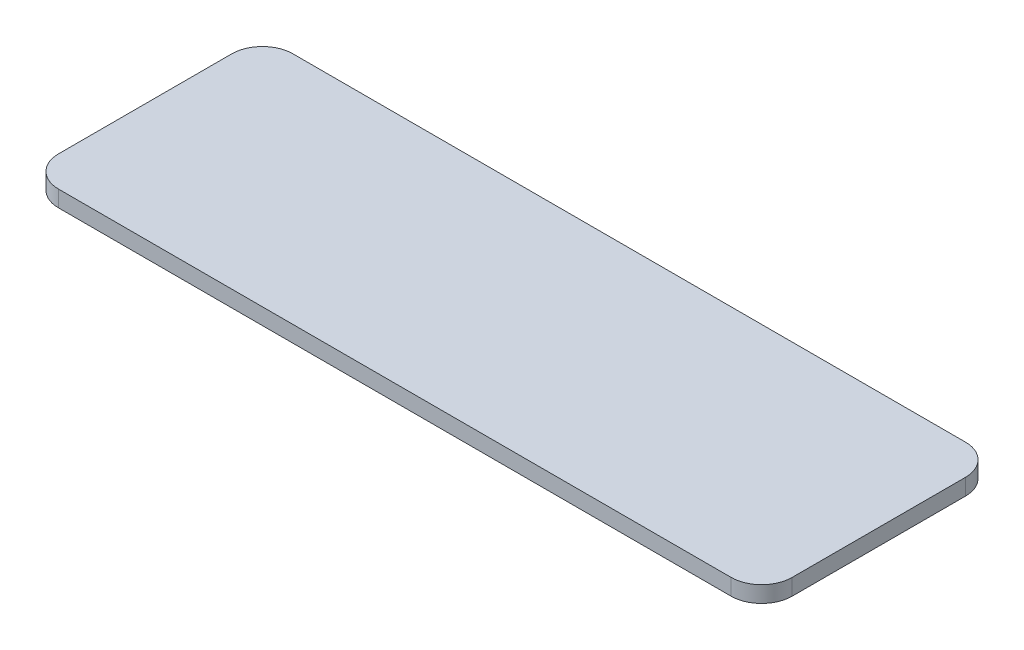
ISO-10303-21;
HEADER;
FILE_DESCRIPTION(('STEP AP214'),'2;1');
FILE_NAME('part.step','',(''),(''),'','','');
FILE_SCHEMA(('AUTOMOTIVE_DESIGN { 1 0 10303 214 1 1 1 1 }'));
ENDSEC;
DATA;
#1=APPLICATION_CONTEXT('core data for automotive mechanical design processes');
#2=APPLICATION_PROTOCOL_DEFINITION('international standard','automotive_design',2000,#1);
#3=PRODUCT_CONTEXT('',#1,'mechanical');
#4=PRODUCT('Part','Part','',(#3));
#5=PRODUCT_RELATED_PRODUCT_CATEGORY('part','',(#4));
#6=PRODUCT_DEFINITION_FORMATION('','',#4);
#7=PRODUCT_DEFINITION_CONTEXT('part definition',#1,'design');
#8=PRODUCT_DEFINITION('design','',#6,#7);
#9=PRODUCT_DEFINITION_SHAPE('','',#8);
#10=(LENGTH_UNIT() NAMED_UNIT(*) SI_UNIT(.MILLI.,.METRE.));
#11=(NAMED_UNIT(*) PLANE_ANGLE_UNIT() SI_UNIT($,.RADIAN.));
#12=(NAMED_UNIT(*) SI_UNIT($,.STERADIAN.) SOLID_ANGLE_UNIT());
#13=UNCERTAINTY_MEASURE_WITH_UNIT(LENGTH_MEASURE(1.E-05),#10,'distance_accuracy_value','');
#14=(GEOMETRIC_REPRESENTATION_CONTEXT(3) GLOBAL_UNCERTAINTY_ASSIGNED_CONTEXT((#13)) GLOBAL_UNIT_ASSIGNED_CONTEXT((#10,
#11,#12)) REPRESENTATION_CONTEXT('',''));
#15=CARTESIAN_POINT('',(0.,0.,0.));
#16=DIRECTION('',(0.,0.,1.));
#17=DIRECTION('',(1.,0.,0.));
#18=AXIS2_PLACEMENT_3D('',#15,#16,#17);
#19=CARTESIAN_POINT('',(3.,1.6,-3.));
#20=DIRECTION('',(0.,-1.,0.));
#21=DIRECTION('',(0.,0.,-1.));
#22=AXIS2_PLACEMENT_3D('',#19,#20,#21);
#23=CYLINDRICAL_SURFACE('',#22,3.);
#24=CARTESIAN_POINT('',(3.,0.,-3.));
#25=DIRECTION('',(0.,1.,0.));
#26=DIRECTION('',(0.,0.,-1.));
#27=AXIS2_PLACEMENT_3D('',#24,#25,#26);
#28=CIRCLE('',#27,3.);
#29=CARTESIAN_POINT('',(0.,0.,-3.00000000000002));
#30=VERTEX_POINT('',#29);
#31=CARTESIAN_POINT('',(3.00000000000002,0.,0.));
#32=VERTEX_POINT('',#31);
#33=EDGE_CURVE('E129',#30,#32,#28,.T.);
#34=ORIENTED_EDGE('',*,*,#33,.T.);
#35=DIRECTION('',(0.,-1.,0.));
#36=VECTOR('',#35,1.);
#37=CARTESIAN_POINT('',(3.00000000000002,1.6,0.));
#38=LINE('',#37,#36);
#39=CARTESIAN_POINT('',(3.00000000000002,1.6,0.));
#40=VERTEX_POINT('',#39);
#41=EDGE_CURVE('E11',#40,#32,#38,.T.);
#42=ORIENTED_EDGE('',*,*,#41,.F.);
#43=CARTESIAN_POINT('',(3.,1.6,-3.));
#44=DIRECTION('',(0.,1.,0.));
#45=DIRECTION('',(0.,0.,-1.));
#46=AXIS2_PLACEMENT_3D('',#43,#44,#45);
#47=CIRCLE('',#46,3.);
#48=CARTESIAN_POINT('',(0.,1.6,-3.00000000000002));
#49=VERTEX_POINT('',#48);
#50=EDGE_CURVE('E143',#49,#40,#47,.T.);
#51=ORIENTED_EDGE('',*,*,#50,.F.);
#52=DIRECTION('',(0.,-1.,0.));
#53=VECTOR('',#52,1.);
#54=CARTESIAN_POINT('',(0.,1.6,-3.00000000000002));
#55=LINE('',#54,#53);
#56=EDGE_CURVE('E125',#49,#30,#55,.T.);
#57=ORIENTED_EDGE('',*,*,#56,.T.);
#58=EDGE_LOOP('',(#34,#42,#51,#57));
#59=FACE_BOUND('',#58,.T.);
#60=ADVANCED_FACE('F33',(#59),#23,.T.);
#61=CARTESIAN_POINT('',(3.00000000000002,1.6,0.));
#62=DIRECTION('',(0.,0.,-1.));
#63=DIRECTION('',(-1.,0.,0.));
#64=AXIS2_PLACEMENT_3D('',#61,#62,#63);
#65=PLANE('',#64);
#66=DIRECTION('',(1.,0.,0.));
#67=VECTOR('',#66,1.);
#68=CARTESIAN_POINT('',(3.00000000000002,0.,0.));
#69=LINE('',#68,#67);
#70=CARTESIAN_POINT('',(69.,0.,0.));
#71=VERTEX_POINT('',#70);
#72=EDGE_CURVE('E132',#32,#71,#69,.T.);
#73=ORIENTED_EDGE('',*,*,#72,.T.);
#74=DIRECTION('',(0.,-1.,0.));
#75=VECTOR('',#74,1.);
#76=CARTESIAN_POINT('',(69.,1.6,0.));
#77=LINE('',#76,#75);
#78=CARTESIAN_POINT('',(69.,1.6,0.));
#79=VERTEX_POINT('',#78);
#80=EDGE_CURVE('E41',#79,#71,#77,.T.);
#81=ORIENTED_EDGE('',*,*,#80,.F.);
#82=DIRECTION('',(1.,0.,0.));
#83=VECTOR('',#82,1.);
#84=CARTESIAN_POINT('',(3.00000000000002,1.6,0.));
#85=LINE('',#84,#83);
#86=EDGE_CURVE('E92',#40,#79,#85,.T.);
#87=ORIENTED_EDGE('',*,*,#86,.F.);
#88=ORIENTED_EDGE('',*,*,#41,.T.);
#89=EDGE_LOOP('',(#73,#81,#87,#88));
#90=FACE_BOUND('',#89,.T.);
#91=ADVANCED_FACE('F178',(#90),#65,.F.);
#92=CARTESIAN_POINT('',(69.,1.6,-3.));
#93=DIRECTION('',(0.,-1.,0.));
#94=DIRECTION('',(0.,0.,-1.));
#95=AXIS2_PLACEMENT_3D('',#92,#93,#94);
#96=CYLINDRICAL_SURFACE('',#95,3.);
#97=CARTESIAN_POINT('',(69.,0.,-3.));
#98=DIRECTION('',(0.,1.,0.));
#99=DIRECTION('',(0.,0.,1.));
#100=AXIS2_PLACEMENT_3D('',#97,#98,#99);
#101=CIRCLE('',#100,3.);
#102=CARTESIAN_POINT('',(72.,0.,-3.));
#103=VERTEX_POINT('',#102);
#104=EDGE_CURVE('E134',#71,#103,#101,.T.);
#105=ORIENTED_EDGE('',*,*,#104,.T.);
#106=DIRECTION('',(0.,-1.,0.));
#107=VECTOR('',#106,1.);
#108=CARTESIAN_POINT('',(72.,1.6,-3.));
#109=LINE('',#108,#107);
#110=CARTESIAN_POINT('',(72.,1.6,-3.));
#111=VERTEX_POINT('',#110);
#112=EDGE_CURVE('E150',#111,#103,#109,.T.);
#113=ORIENTED_EDGE('',*,*,#112,.F.);
#114=CARTESIAN_POINT('',(69.,1.6,-3.));
#115=DIRECTION('',(0.,1.,0.));
#116=DIRECTION('',(0.,0.,1.));
#117=AXIS2_PLACEMENT_3D('',#114,#115,#116);
#118=CIRCLE('',#117,3.);
#119=EDGE_CURVE('E158',#79,#111,#118,.T.);
#120=ORIENTED_EDGE('',*,*,#119,.F.);
#121=ORIENTED_EDGE('',*,*,#80,.T.);
#122=EDGE_LOOP('',(#105,#113,#120,#121));
#123=FACE_BOUND('',#122,.T.);
#124=ADVANCED_FACE('F156',(#123),#96,.T.);
#125=CARTESIAN_POINT('',(72.,1.6,-3.));
#126=DIRECTION('',(-1.,0.,0.));
#127=DIRECTION('',(0.,0.,1.));
#128=AXIS2_PLACEMENT_3D('',#125,#126,#127);
#129=PLANE('',#128);
#130=DIRECTION('',(0.,0.,-1.));
#131=VECTOR('',#130,1.);
#132=CARTESIAN_POINT('',(72.,0.,-3.));
#133=LINE('',#132,#131);
#134=CARTESIAN_POINT('',(72.,0.,-20.));
#135=VERTEX_POINT('',#134);
#136=EDGE_CURVE('E136',#103,#135,#133,.T.);
#137=ORIENTED_EDGE('',*,*,#136,.T.);
#138=DIRECTION('',(0.,-1.,0.));
#139=VECTOR('',#138,1.);
#140=CARTESIAN_POINT('',(72.,1.6,-20.));
#141=LINE('',#140,#139);
#142=CARTESIAN_POINT('',(72.,1.6,-20.));
#143=VERTEX_POINT('',#142);
#144=EDGE_CURVE('E147',#143,#135,#141,.T.);
#145=ORIENTED_EDGE('',*,*,#144,.F.);
#146=DIRECTION('',(0.,0.,-1.));
#147=VECTOR('',#146,1.);
#148=CARTESIAN_POINT('',(72.,1.6,-3.));
#149=LINE('',#148,#147);
#150=EDGE_CURVE('E170',#111,#143,#149,.T.);
#151=ORIENTED_EDGE('',*,*,#150,.F.);
#152=ORIENTED_EDGE('',*,*,#112,.T.);
#153=EDGE_LOOP('',(#137,#145,#151,#152));
#154=FACE_BOUND('',#153,.T.);
#155=ADVANCED_FACE('F166',(#154),#129,.F.);
#156=CARTESIAN_POINT('',(69.,1.6,-20.));
#157=DIRECTION('',(0.,-1.,0.));
#158=DIRECTION('',(0.,0.,-1.));
#159=AXIS2_PLACEMENT_3D('',#156,#157,#158);
#160=CYLINDRICAL_SURFACE('',#159,3.);
#161=CARTESIAN_POINT('',(69.,0.,-20.));
#162=DIRECTION('',(0.,1.,0.));
#163=DIRECTION('',(0.,0.,-1.));
#164=AXIS2_PLACEMENT_3D('',#161,#162,#163);
#165=CIRCLE('',#164,3.);
#166=CARTESIAN_POINT('',(69.,0.,-23.));
#167=VERTEX_POINT('',#166);
#168=EDGE_CURVE('E138',#135,#167,#165,.T.);
#169=ORIENTED_EDGE('',*,*,#168,.T.);
#170=DIRECTION('',(0.,-1.,0.));
#171=VECTOR('',#170,1.);
#172=CARTESIAN_POINT('',(69.,1.6,-23.));
#173=LINE('',#172,#171);
#174=CARTESIAN_POINT('',(69.,1.6,-23.));
#175=VERTEX_POINT('',#174);
#176=EDGE_CURVE('E120',#175,#167,#173,.T.);
#177=ORIENTED_EDGE('',*,*,#176,.F.);
#178=CARTESIAN_POINT('',(69.,1.6,-20.));
#179=DIRECTION('',(0.,1.,0.));
#180=DIRECTION('',(0.,0.,-1.));
#181=AXIS2_PLACEMENT_3D('',#178,#179,#180);
#182=CIRCLE('',#181,3.);
#183=EDGE_CURVE('E111',#143,#175,#182,.T.);
#184=ORIENTED_EDGE('',*,*,#183,.F.);
#185=ORIENTED_EDGE('',*,*,#144,.T.);
#186=EDGE_LOOP('',(#169,#177,#184,#185));
#187=FACE_BOUND('',#186,.T.);
#188=ADVANCED_FACE('F169',(#187),#160,.T.);
#189=CARTESIAN_POINT('',(3.00000000000002,1.6,-23.));
#190=DIRECTION('',(0.,0.,1.));
#191=DIRECTION('',(1.,0.,0.));
#192=AXIS2_PLACEMENT_3D('',#189,#190,#191);
#193=PLANE('',#192);
#194=DIRECTION('',(-1.,0.,0.));
#195=VECTOR('',#194,1.);
#196=CARTESIAN_POINT('',(3.00000000000002,0.,-23.));
#197=LINE('',#196,#195);
#198=CARTESIAN_POINT('',(3.00000000000002,0.,-23.));
#199=VERTEX_POINT('',#198);
#200=EDGE_CURVE('E119',#167,#199,#197,.T.);
#201=ORIENTED_EDGE('',*,*,#200,.T.);
#202=DIRECTION('',(0.,-1.,0.));
#203=VECTOR('',#202,1.);
#204=CARTESIAN_POINT('',(3.00000000000002,1.6,-23.));
#205=LINE('',#204,#203);
#206=CARTESIAN_POINT('',(3.00000000000002,1.6,-23.));
#207=VERTEX_POINT('',#206);
#208=EDGE_CURVE('E116',#207,#199,#205,.T.);
#209=ORIENTED_EDGE('',*,*,#208,.F.);
#210=DIRECTION('',(-1.,0.,0.));
#211=VECTOR('',#210,1.);
#212=CARTESIAN_POINT('',(3.00000000000002,1.6,-23.));
#213=LINE('',#212,#211);
#214=EDGE_CURVE('E105',#175,#207,#213,.T.);
#215=ORIENTED_EDGE('',*,*,#214,.F.);
#216=ORIENTED_EDGE('',*,*,#176,.T.);
#217=EDGE_LOOP('',(#201,#209,#215,#216));
#218=FACE_BOUND('',#217,.T.);
#219=ADVANCED_FACE('F117',(#218),#193,.F.);
#220=CARTESIAN_POINT('',(3.,1.6,-20.));
#221=DIRECTION('',(0.,-1.,0.));
#222=DIRECTION('',(0.,0.,-1.));
#223=AXIS2_PLACEMENT_3D('',#220,#221,#222);
#224=CYLINDRICAL_SURFACE('',#223,3.);
#225=CARTESIAN_POINT('',(3.,0.,-20.));
#226=DIRECTION('',(0.,1.,0.));
#227=DIRECTION('',(0.,0.,-1.));
#228=AXIS2_PLACEMENT_3D('',#225,#226,#227);
#229=CIRCLE('',#228,3.);
#230=CARTESIAN_POINT('',(0.,0.,-20.));
#231=VERTEX_POINT('',#230);
#232=EDGE_CURVE('E78',#199,#231,#229,.T.);
#233=ORIENTED_EDGE('',*,*,#232,.T.);
#234=DIRECTION('',(0.,-1.,0.));
#235=VECTOR('',#234,1.);
#236=CARTESIAN_POINT('',(0.,1.6,-20.));
#237=LINE('',#236,#235);
#238=CARTESIAN_POINT('',(0.,1.6,-20.));
#239=VERTEX_POINT('',#238);
#240=EDGE_CURVE('E121',#239,#231,#237,.T.);
#241=ORIENTED_EDGE('',*,*,#240,.F.);
#242=CARTESIAN_POINT('',(3.,1.6,-20.));
#243=DIRECTION('',(0.,1.,0.));
#244=DIRECTION('',(0.,0.,-1.));
#245=AXIS2_PLACEMENT_3D('',#242,#243,#244);
#246=CIRCLE('',#245,3.);
#247=EDGE_CURVE('E109',#207,#239,#246,.T.);
#248=ORIENTED_EDGE('',*,*,#247,.F.);
#249=ORIENTED_EDGE('',*,*,#208,.T.);
#250=EDGE_LOOP('',(#233,#241,#248,#249));
#251=FACE_BOUND('',#250,.T.);
#252=ADVANCED_FACE('F123',(#251),#224,.T.);
#253=CARTESIAN_POINT('',(0.,1.6,-3.00000000000002));
#254=DIRECTION('',(1.,0.,0.));
#255=DIRECTION('',(0.,0.,-1.));
#256=AXIS2_PLACEMENT_3D('',#253,#254,#255);
#257=PLANE('',#256);
#258=DIRECTION('',(0.,0.,1.));
#259=VECTOR('',#258,1.);
#260=CARTESIAN_POINT('',(0.,0.,-3.00000000000002));
#261=LINE('',#260,#259);
#262=EDGE_CURVE('E84',#231,#30,#261,.T.);
#263=ORIENTED_EDGE('',*,*,#262,.T.);
#264=ORIENTED_EDGE('',*,*,#56,.F.);
#265=DIRECTION('',(0.,0.,1.));
#266=VECTOR('',#265,1.);
#267=CARTESIAN_POINT('',(0.,1.6,-3.00000000000002));
#268=LINE('',#267,#266);
#269=EDGE_CURVE('E49',#239,#49,#268,.T.);
#270=ORIENTED_EDGE('',*,*,#269,.F.);
#271=ORIENTED_EDGE('',*,*,#240,.T.);
#272=EDGE_LOOP('',(#263,#264,#270,#271));
#273=FACE_BOUND('',#272,.T.);
#274=ADVANCED_FACE('F194',(#273),#257,.F.);
#275=CARTESIAN_POINT('',(3.,1.6,-3.));
#276=DIRECTION('',(0.,-1.,0.));
#277=DIRECTION('',(0.,0.,-1.));
#278=AXIS2_PLACEMENT_3D('',#275,#276,#277);
#279=PLANE('',#278);
#280=ORIENTED_EDGE('',*,*,#50,.T.);
#281=ORIENTED_EDGE('',*,*,#86,.T.);
#282=ORIENTED_EDGE('',*,*,#119,.T.);
#283=ORIENTED_EDGE('',*,*,#150,.T.);
#284=ORIENTED_EDGE('',*,*,#183,.T.);
#285=ORIENTED_EDGE('',*,*,#214,.T.);
#286=ORIENTED_EDGE('',*,*,#247,.T.);
#287=ORIENTED_EDGE('',*,*,#269,.T.);
#288=EDGE_LOOP('',(#280,#281,#282,#283,#284,#285,#286,#287));
#289=FACE_BOUND('',#288,.T.);
#290=ADVANCED_FACE('F107',(#289),#279,.F.);
#291=CARTESIAN_POINT('',(3.,0.,-3.));
#292=DIRECTION('',(0.,-1.,0.));
#293=DIRECTION('',(0.,0.,-1.));
#294=AXIS2_PLACEMENT_3D('',#291,#292,#293);
#295=PLANE('',#294);
#296=ORIENTED_EDGE('',*,*,#33,.F.);
#297=ORIENTED_EDGE('',*,*,#262,.F.);
#298=ORIENTED_EDGE('',*,*,#232,.F.);
#299=ORIENTED_EDGE('',*,*,#200,.F.);
#300=ORIENTED_EDGE('',*,*,#168,.F.);
#301=ORIENTED_EDGE('',*,*,#136,.F.);
#302=ORIENTED_EDGE('',*,*,#104,.F.);
#303=ORIENTED_EDGE('',*,*,#72,.F.);
#304=EDGE_LOOP('',(#296,#297,#298,#299,#300,#301,#302,#303));
#305=FACE_BOUND('',#304,.T.);
#306=ADVANCED_FACE('F162',(#305),#295,.T.);
#307=CLOSED_SHELL('',(#60,#91,#124,#155,#188,#219,#252,#274,#290,#306));
#308=MANIFOLD_SOLID_BREP('B2',#307);
#309=ADVANCED_BREP_SHAPE_REPRESENTATION('',(#18,#308),#14);
#310=SHAPE_DEFINITION_REPRESENTATION(#9,#309);
ENDSEC;
END-ISO-10303-21;
